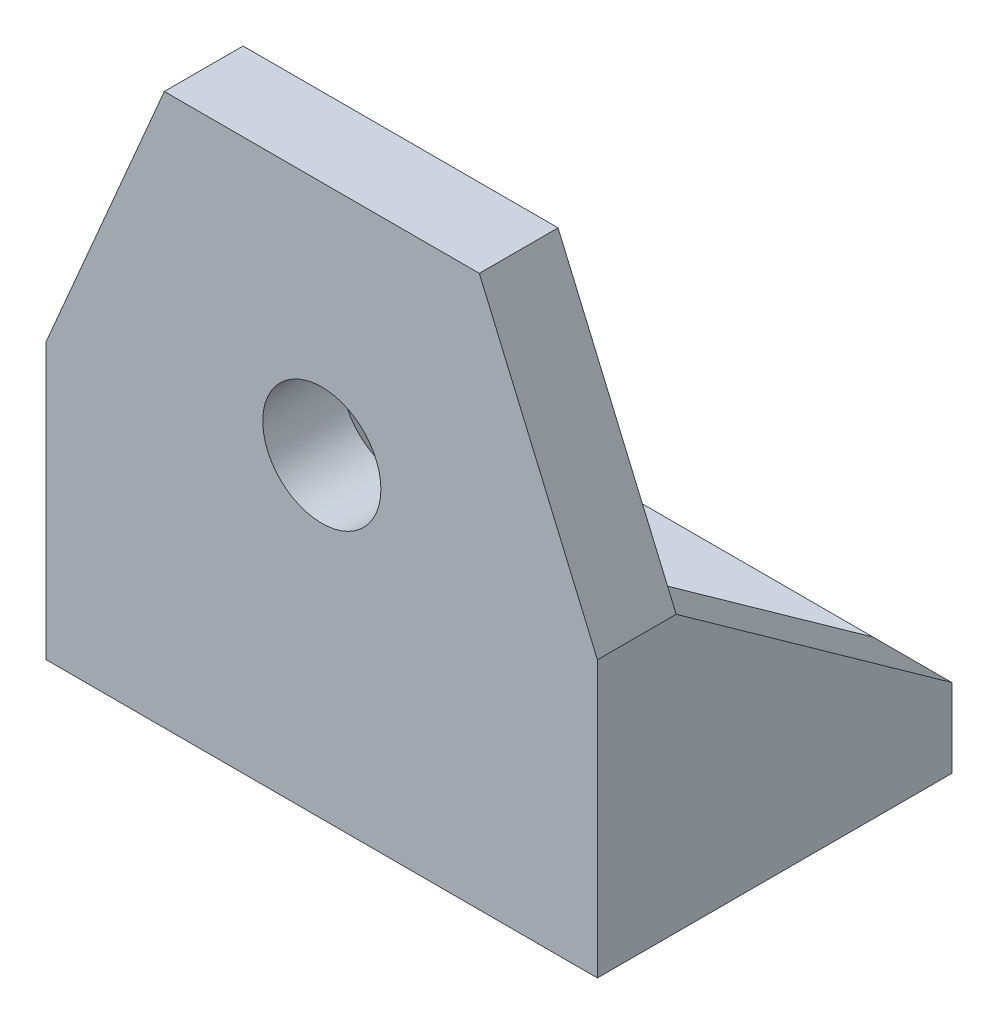
ISO-10303-21;
HEADER;
FILE_DESCRIPTION(('STEP AP214'),'2;1');
FILE_NAME('part.step','',(''),(''),'','','');
FILE_SCHEMA(('AUTOMOTIVE_DESIGN { 1 0 10303 214 1 1 1 1 }'));
ENDSEC;
DATA;
#1=APPLICATION_CONTEXT('core data for automotive mechanical design processes');
#2=APPLICATION_PROTOCOL_DEFINITION('international standard','automotive_design',2000,#1);
#3=PRODUCT_CONTEXT('',#1,'mechanical');
#4=PRODUCT('Part','Part','',(#3));
#5=PRODUCT_RELATED_PRODUCT_CATEGORY('part','',(#4));
#6=PRODUCT_DEFINITION_FORMATION('','',#4);
#7=PRODUCT_DEFINITION_CONTEXT('part definition',#1,'design');
#8=PRODUCT_DEFINITION('design','',#6,#7);
#9=PRODUCT_DEFINITION_SHAPE('','',#8);
#10=(LENGTH_UNIT() NAMED_UNIT(*) SI_UNIT(.MILLI.,.METRE.));
#11=(NAMED_UNIT(*) PLANE_ANGLE_UNIT() SI_UNIT($,.RADIAN.));
#12=(NAMED_UNIT(*) SI_UNIT($,.STERADIAN.) SOLID_ANGLE_UNIT());
#13=UNCERTAINTY_MEASURE_WITH_UNIT(LENGTH_MEASURE(1.E-05),#10,'distance_accuracy_value','');
#14=(GEOMETRIC_REPRESENTATION_CONTEXT(3) GLOBAL_UNCERTAINTY_ASSIGNED_CONTEXT((#13)) GLOBAL_UNIT_ASSIGNED_CONTEXT((#10,
#11,#12)) REPRESENTATION_CONTEXT('',''));
#15=CARTESIAN_POINT('',(0.,0.,0.));
#16=DIRECTION('',(0.,0.,1.));
#17=DIRECTION('',(1.,0.,0.));
#18=AXIS2_PLACEMENT_3D('',#15,#16,#17);
#19=CARTESIAN_POINT('',(0.,2.,0.));
#20=DIRECTION('',(0.,1.,0.));
#21=DIRECTION('',(0.,0.,1.));
#22=AXIS2_PLACEMENT_3D('',#19,#20,#21);
#23=PLANE('',#22);
#24=CARTESIAN_POINT('',(-3.,2.,-0.999999999999999));
#25=DIRECTION('',(0.,1.,0.));
#26=DIRECTION('',(0.,0.,1.));
#27=AXIS2_PLACEMENT_3D('',#24,#25,#26);
#28=CIRCLE('',#27,1.25);
#29=CARTESIAN_POINT('',(-3.,2.,0.250000000000002));
#30=VERTEX_POINT('',#29);
#31=EDGE_CURVE('E180',#30,#30,#28,.T.);
#32=ORIENTED_EDGE('',*,*,#31,.F.);
#33=EDGE_LOOP('',(#32));
#34=FACE_BOUND('',#33,.T.);
#35=CARTESIAN_POINT('',(3.,2.,-1.));
#36=DIRECTION('',(0.,1.,0.));
#37=DIRECTION('',(0.,0.,1.));
#38=AXIS2_PLACEMENT_3D('',#35,#36,#37);
#39=CIRCLE('',#38,1.25);
#40=CARTESIAN_POINT('',(3.,2.,0.249999999999998));
#41=VERTEX_POINT('',#40);
#42=EDGE_CURVE('E172',#41,#41,#39,.T.);
#43=ORIENTED_EDGE('',*,*,#42,.F.);
#44=EDGE_LOOP('',(#43));
#45=FACE_BOUND('',#44,.T.);
#46=DIRECTION('',(-1.,0.,0.));
#47=VECTOR('',#46,1.);
#48=CARTESIAN_POINT('',(-7.,2.,-4.5));
#49=LINE('',#48,#47);
#50=CARTESIAN_POINT('',(5.,2.,-4.5));
#51=VERTEX_POINT('',#50);
#52=CARTESIAN_POINT('',(-5.,2.,-4.5));
#53=VERTEX_POINT('',#52);
#54=EDGE_CURVE('E191',#51,#53,#49,.T.);
#55=ORIENTED_EDGE('',*,*,#54,.T.);
#56=DIRECTION('',(0.,0.,1.));
#57=VECTOR('',#56,1.);
#58=CARTESIAN_POINT('',(-5.,2.,-9.8851648071345));
#59=LINE('',#58,#57);
#60=CARTESIAN_POINT('',(-5.,2.,2.5));
#61=VERTEX_POINT('',#60);
#62=EDGE_CURVE('E55',#53,#61,#59,.T.);
#63=ORIENTED_EDGE('',*,*,#62,.T.);
#64=DIRECTION('',(-1.,0.,0.));
#65=VECTOR('',#64,1.);
#66=CARTESIAN_POINT('',(-7.,2.,2.5));
#67=LINE('',#66,#65);
#68=CARTESIAN_POINT('',(4.99999999999999,2.,2.5));
#69=VERTEX_POINT('',#68);
#70=EDGE_CURVE('E161',#69,#61,#67,.T.);
#71=ORIENTED_EDGE('',*,*,#70,.F.);
#72=DIRECTION('',(0.,0.,1.));
#73=VECTOR('',#72,1.);
#74=CARTESIAN_POINT('',(5.,2.,-9.8851648071345));
#75=LINE('',#74,#73);
#76=EDGE_CURVE('E126',#51,#69,#75,.T.);
#77=ORIENTED_EDGE('',*,*,#76,.F.);
#78=EDGE_LOOP('',(#55,#63,#71,#77));
#79=FACE_BOUND('',#78,.T.);
#80=ADVANCED_FACE('F39',(#34,#45,#79),#23,.T.);
#81=CARTESIAN_POINT('',(-7.,14.,2.5));
#82=DIRECTION('',(0.,0.,1.));
#83=DIRECTION('',(1.,0.,0.));
#84=AXIS2_PLACEMENT_3D('',#81,#82,#83);
#85=PLANE('',#84);
#86=CARTESIAN_POINT('',(0.,8.,2.5));
#87=DIRECTION('',(0.,0.,1.));
#88=DIRECTION('',(1.,0.,0.));
#89=AXIS2_PLACEMENT_3D('',#86,#87,#88);
#90=CIRCLE('',#89,1.5);
#91=CARTESIAN_POINT('',(1.5,8.,2.5));
#92=VERTEX_POINT('',#91);
#93=EDGE_CURVE('E138',#92,#92,#90,.F.);
#94=ORIENTED_EDGE('',*,*,#93,.F.);
#95=EDGE_LOOP('',(#94));
#96=FACE_BOUND('',#95,.T.);
#97=DIRECTION('',(0.,-1.,0.));
#98=VECTOR('',#97,1.);
#99=CARTESIAN_POINT('',(-5.,7.,2.5));
#100=LINE('',#99,#98);
#101=CARTESIAN_POINT('',(-5.,7.,2.5));
#102=VERTEX_POINT('',#101);
#103=EDGE_CURVE('E236',#102,#61,#100,.T.);
#104=ORIENTED_EDGE('',*,*,#103,.F.);
#105=DIRECTION('',(1.,0.,0.));
#106=VECTOR('',#105,1.);
#107=CARTESIAN_POINT('',(-7.,7.,2.5));
#108=LINE('',#107,#106);
#109=CARTESIAN_POINT('',(-7.,7.,2.5));
#110=VERTEX_POINT('',#109);
#111=EDGE_CURVE('E240',#110,#102,#108,.T.);
#112=ORIENTED_EDGE('',*,*,#111,.F.);
#113=DIRECTION('',(0.393919298579168,0.919145030018058,0.));
#114=VECTOR('',#113,1.);
#115=CARTESIAN_POINT('',(-4.46551724137931,12.9137931034483,2.5));
#116=LINE('',#115,#114);
#117=CARTESIAN_POINT('',(-4.,14.,2.5));
#118=VERTEX_POINT('',#117);
#119=EDGE_CURVE('E156',#110,#118,#116,.T.);
#120=ORIENTED_EDGE('',*,*,#119,.T.);
#121=DIRECTION('',(-1.,0.,0.));
#122=VECTOR('',#121,1.);
#123=CARTESIAN_POINT('',(-7.,14.,2.5));
#124=LINE('',#123,#122);
#125=CARTESIAN_POINT('',(4.,14.,2.5));
#126=VERTEX_POINT('',#125);
#127=EDGE_CURVE('E154',#126,#118,#124,.T.);
#128=ORIENTED_EDGE('',*,*,#127,.F.);
#129=DIRECTION('',(0.393919298579167,-0.919145030018058,0.));
#130=VECTOR('',#129,1.);
#131=CARTESIAN_POINT('',(2.29310344827586,17.9827586206897,2.5));
#132=LINE('',#131,#130);
#133=CARTESIAN_POINT('',(7.,7.,2.5));
#134=VERTEX_POINT('',#133);
#135=EDGE_CURVE('E142',#126,#134,#132,.T.);
#136=ORIENTED_EDGE('',*,*,#135,.T.);
#137=DIRECTION('',(1.,0.,0.));
#138=VECTOR('',#137,1.);
#139=CARTESIAN_POINT('',(7.,7.,2.5));
#140=LINE('',#139,#138);
#141=CARTESIAN_POINT('',(5.,7.,2.5));
#142=VERTEX_POINT('',#141);
#143=EDGE_CURVE('E117',#142,#134,#140,.T.);
#144=ORIENTED_EDGE('',*,*,#143,.F.);
#145=DIRECTION('',(0.,1.,0.));
#146=VECTOR('',#145,1.);
#147=CARTESIAN_POINT('',(5.,7.,2.5));
#148=LINE('',#147,#146);
#149=EDGE_CURVE('E127',#69,#142,#148,.T.);
#150=ORIENTED_EDGE('',*,*,#149,.F.);
#151=ORIENTED_EDGE('',*,*,#70,.T.);
#152=EDGE_LOOP('',(#104,#112,#120,#128,#136,#144,#150,#151));
#153=FACE_BOUND('',#152,.T.);
#154=ADVANCED_FACE('F151',(#96,#153),#85,.F.);
#155=CARTESIAN_POINT('',(7.,2.,-4.5));
#156=DIRECTION('',(-1.,0.,0.));
#157=DIRECTION('',(0.,0.,1.));
#158=AXIS2_PLACEMENT_3D('',#155,#156,#157);
#159=PLANE('',#158);
#160=DIRECTION('',(0.,-1.,0.));
#161=VECTOR('',#160,1.);
#162=CARTESIAN_POINT('',(7.,2.,-4.5));
#163=LINE('',#162,#161);
#164=CARTESIAN_POINT('',(7.,2.,-4.5));
#165=VERTEX_POINT('',#164);
#166=CARTESIAN_POINT('',(7.,0.,-4.5));
#167=VERTEX_POINT('',#166);
#168=EDGE_CURVE('E136',#165,#167,#163,.T.);
#169=ORIENTED_EDGE('',*,*,#168,.F.);
#170=DIRECTION('',(0.,-0.581238193719096,-0.813733471206735));
#171=VECTOR('',#170,1.);
#172=CARTESIAN_POINT('',(7.,7.,2.5));
#173=LINE('',#172,#171);
#174=EDGE_CURVE('E120',#134,#165,#173,.T.);
#175=ORIENTED_EDGE('',*,*,#174,.F.);
#176=DIRECTION('',(0.,0.,1.));
#177=VECTOR('',#176,1.);
#178=CARTESIAN_POINT('',(7.,7.,-7.5));
#179=LINE('',#178,#177);
#180=CARTESIAN_POINT('',(7.,7.,4.5));
#181=VERTEX_POINT('',#180);
#182=EDGE_CURVE('E133',#134,#181,#179,.T.);
#183=ORIENTED_EDGE('',*,*,#182,.T.);
#184=DIRECTION('',(0.,-1.,0.));
#185=VECTOR('',#184,1.);
#186=CARTESIAN_POINT('',(7.,2.,4.5));
#187=LINE('',#186,#185);
#188=CARTESIAN_POINT('',(7.,0.,4.5));
#189=VERTEX_POINT('',#188);
#190=EDGE_CURVE('E194',#181,#189,#187,.T.);
#191=ORIENTED_EDGE('',*,*,#190,.T.);
#192=DIRECTION('',(0.,0.,-1.));
#193=VECTOR('',#192,1.);
#194=CARTESIAN_POINT('',(7.,0.,-4.5));
#195=LINE('',#194,#193);
#196=EDGE_CURVE('E179',#189,#167,#195,.T.);
#197=ORIENTED_EDGE('',*,*,#196,.T.);
#198=EDGE_LOOP('',(#169,#175,#183,#191,#197));
#199=FACE_BOUND('',#198,.T.);
#200=ADVANCED_FACE('F41',(#199),#159,.F.);
#201=CARTESIAN_POINT('',(-7.,2.,-4.5));
#202=DIRECTION('',(0.,0.,1.));
#203=DIRECTION('',(1.,0.,0.));
#204=AXIS2_PLACEMENT_3D('',#201,#202,#203);
#205=PLANE('',#204);
#206=DIRECTION('',(0.,-1.,0.));
#207=VECTOR('',#206,1.);
#208=CARTESIAN_POINT('',(-7.,2.,-4.5));
#209=LINE('',#208,#207);
#210=CARTESIAN_POINT('',(-7.,2.,-4.5));
#211=VERTEX_POINT('',#210);
#212=CARTESIAN_POINT('',(-7.,0.,-4.5));
#213=VERTEX_POINT('',#212);
#214=EDGE_CURVE('E214',#211,#213,#209,.T.);
#215=ORIENTED_EDGE('',*,*,#214,.F.);
#216=DIRECTION('',(1.,0.,0.));
#217=VECTOR('',#216,1.);
#218=CARTESIAN_POINT('',(-15.6023252670426,2.,-4.5));
#219=LINE('',#218,#217);
#220=EDGE_CURVE('E252',#211,#53,#219,.T.);
#221=ORIENTED_EDGE('',*,*,#220,.T.);
#222=ORIENTED_EDGE('',*,*,#54,.F.);
#223=EDGE_CURVE('E63',#51,#165,#219,.T.);
#224=ORIENTED_EDGE('',*,*,#223,.T.);
#225=ORIENTED_EDGE('',*,*,#168,.T.);
#226=DIRECTION('',(-1.,0.,0.));
#227=VECTOR('',#226,1.);
#228=CARTESIAN_POINT('',(-7.,0.,-4.5));
#229=LINE('',#228,#227);
#230=EDGE_CURVE('E198',#167,#213,#229,.T.);
#231=ORIENTED_EDGE('',*,*,#230,.T.);
#232=EDGE_LOOP('',(#215,#221,#222,#224,#225,#231));
#233=FACE_BOUND('',#232,.T.);
#234=ADVANCED_FACE('F277',(#233),#205,.F.);
#235=CARTESIAN_POINT('',(-7.,2.,-4.5));
#236=DIRECTION('',(1.,0.,0.));
#237=DIRECTION('',(0.,0.,-1.));
#238=AXIS2_PLACEMENT_3D('',#235,#236,#237);
#239=PLANE('',#238);
#240=DIRECTION('',(0.,0.,1.));
#241=VECTOR('',#240,1.);
#242=CARTESIAN_POINT('',(-7.,7.,-7.5));
#243=LINE('',#242,#241);
#244=CARTESIAN_POINT('',(-7.,7.,4.5));
#245=VERTEX_POINT('',#244);
#246=EDGE_CURVE('E157',#110,#245,#243,.T.);
#247=ORIENTED_EDGE('',*,*,#246,.F.);
#248=DIRECTION('',(0.,0.581238193719097,0.813733471206735));
#249=VECTOR('',#248,1.);
#250=CARTESIAN_POINT('',(-7.,7.,2.5));
#251=LINE('',#250,#249);
#252=EDGE_CURVE('E249',#211,#110,#251,.T.);
#253=ORIENTED_EDGE('',*,*,#252,.F.);
#254=ORIENTED_EDGE('',*,*,#214,.T.);
#255=DIRECTION('',(0.,0.,1.));
#256=VECTOR('',#255,1.);
#257=CARTESIAN_POINT('',(-7.,0.,-4.5));
#258=LINE('',#257,#256);
#259=CARTESIAN_POINT('',(-7.,0.,4.5));
#260=VERTEX_POINT('',#259);
#261=EDGE_CURVE('E202',#213,#260,#258,.T.);
#262=ORIENTED_EDGE('',*,*,#261,.T.);
#263=DIRECTION('',(0.,-1.,0.));
#264=VECTOR('',#263,1.);
#265=CARTESIAN_POINT('',(-7.,2.,4.5));
#266=LINE('',#265,#264);
#267=EDGE_CURVE('E211',#245,#260,#266,.T.);
#268=ORIENTED_EDGE('',*,*,#267,.F.);
#269=EDGE_LOOP('',(#247,#253,#254,#262,#268));
#270=FACE_BOUND('',#269,.T.);
#271=ADVANCED_FACE('F268',(#270),#239,.F.);
#272=CARTESIAN_POINT('',(-7.,2.,4.5));
#273=DIRECTION('',(0.,0.,-1.));
#274=DIRECTION('',(-1.,0.,0.));
#275=AXIS2_PLACEMENT_3D('',#272,#273,#274);
#276=PLANE('',#275);
#277=CARTESIAN_POINT('',(0.,8.,4.5));
#278=DIRECTION('',(0.,0.,1.));
#279=DIRECTION('',(1.,0.,0.));
#280=AXIS2_PLACEMENT_3D('',#277,#278,#279);
#281=CIRCLE('',#280,1.5);
#282=CARTESIAN_POINT('',(1.5,8.,4.5));
#283=VERTEX_POINT('',#282);
#284=EDGE_CURVE('E259',#283,#283,#281,.T.);
#285=ORIENTED_EDGE('',*,*,#284,.F.);
#286=EDGE_LOOP('',(#285));
#287=FACE_BOUND('',#286,.T.);
#288=DIRECTION('',(1.,0.,0.));
#289=VECTOR('',#288,1.);
#290=CARTESIAN_POINT('',(-7.,14.,4.5));
#291=LINE('',#290,#289);
#292=CARTESIAN_POINT('',(-4.,14.,4.5));
#293=VERTEX_POINT('',#292);
#294=CARTESIAN_POINT('',(4.,14.,4.5));
#295=VERTEX_POINT('',#294);
#296=EDGE_CURVE('E166',#293,#295,#291,.T.);
#297=ORIENTED_EDGE('',*,*,#296,.F.);
#298=DIRECTION('',(0.393919298579168,0.919145030018058,0.));
#299=VECTOR('',#298,1.);
#300=CARTESIAN_POINT('',(-7.,7.,4.5));
#301=LINE('',#300,#299);
#302=EDGE_CURVE('E147',#245,#293,#301,.T.);
#303=ORIENTED_EDGE('',*,*,#302,.F.);
#304=ORIENTED_EDGE('',*,*,#267,.T.);
#305=DIRECTION('',(1.,0.,0.));
#306=VECTOR('',#305,1.);
#307=CARTESIAN_POINT('',(-7.,0.,4.5));
#308=LINE('',#307,#306);
#309=EDGE_CURVE('E195',#260,#189,#308,.T.);
#310=ORIENTED_EDGE('',*,*,#309,.T.);
#311=ORIENTED_EDGE('',*,*,#190,.F.);
#312=DIRECTION('',(0.393919298579167,-0.919145030018058,0.));
#313=VECTOR('',#312,1.);
#314=CARTESIAN_POINT('',(4.,14.,4.5));
#315=LINE('',#314,#313);
#316=EDGE_CURVE('E145',#295,#181,#315,.T.);
#317=ORIENTED_EDGE('',*,*,#316,.F.);
#318=EDGE_LOOP('',(#297,#303,#304,#310,#311,#317));
#319=FACE_BOUND('',#318,.T.);
#320=ADVANCED_FACE('F223',(#287,#319),#276,.F.);
#321=CARTESIAN_POINT('',(0.,0.,0.));
#322=DIRECTION('',(0.,1.,0.));
#323=DIRECTION('',(0.,0.,1.));
#324=AXIS2_PLACEMENT_3D('',#321,#322,#323);
#325=PLANE('',#324);
#326=CARTESIAN_POINT('',(-3.,0.,-0.999999999999999));
#327=DIRECTION('',(0.,1.,0.));
#328=DIRECTION('',(0.,0.,1.));
#329=AXIS2_PLACEMENT_3D('',#326,#327,#328);
#330=CIRCLE('',#329,1.25);
#331=CARTESIAN_POINT('',(-3.,0.,0.250000000000002));
#332=VERTEX_POINT('',#331);
#333=EDGE_CURVE('E175',#332,#332,#330,.T.);
#334=ORIENTED_EDGE('',*,*,#333,.T.);
#335=EDGE_LOOP('',(#334));
#336=FACE_BOUND('',#335,.T.);
#337=CARTESIAN_POINT('',(3.,0.,-1.));
#338=DIRECTION('',(0.,1.,0.));
#339=DIRECTION('',(0.,0.,1.));
#340=AXIS2_PLACEMENT_3D('',#337,#338,#339);
#341=CIRCLE('',#340,1.25);
#342=CARTESIAN_POINT('',(3.,0.,0.249999999999998));
#343=VERTEX_POINT('',#342);
#344=EDGE_CURVE('E184',#343,#343,#341,.T.);
#345=ORIENTED_EDGE('',*,*,#344,.T.);
#346=EDGE_LOOP('',(#345));
#347=FACE_BOUND('',#346,.T.);
#348=ORIENTED_EDGE('',*,*,#196,.F.);
#349=ORIENTED_EDGE('',*,*,#309,.F.);
#350=ORIENTED_EDGE('',*,*,#261,.F.);
#351=ORIENTED_EDGE('',*,*,#230,.F.);
#352=EDGE_LOOP('',(#348,#349,#350,#351));
#353=FACE_BOUND('',#352,.T.);
#354=ADVANCED_FACE('F267',(#336,#347,#353),#325,.F.);
#355=CARTESIAN_POINT('',(3.,0.,-1.));
#356=DIRECTION('',(0.,1.,0.));
#357=DIRECTION('',(0.,0.,1.));
#358=AXIS2_PLACEMENT_3D('',#355,#356,#357);
#359=CYLINDRICAL_SURFACE('',#358,1.25);
#360=ORIENTED_EDGE('',*,*,#344,.F.);
#361=EDGE_LOOP('',(#360));
#362=FACE_BOUND('',#361,.T.);
#363=ORIENTED_EDGE('',*,*,#42,.T.);
#364=EDGE_LOOP('',(#363));
#365=FACE_BOUND('',#364,.T.);
#366=ADVANCED_FACE('F274',(#362,#365),#359,.F.);
#367=CARTESIAN_POINT('',(-3.,0.,-0.999999999999999));
#368=DIRECTION('',(0.,1.,0.));
#369=DIRECTION('',(0.,0.,1.));
#370=AXIS2_PLACEMENT_3D('',#367,#368,#369);
#371=CYLINDRICAL_SURFACE('',#370,1.25);
#372=ORIENTED_EDGE('',*,*,#333,.F.);
#373=EDGE_LOOP('',(#372));
#374=FACE_BOUND('',#373,.T.);
#375=ORIENTED_EDGE('',*,*,#31,.T.);
#376=EDGE_LOOP('',(#375));
#377=FACE_BOUND('',#376,.T.);
#378=ADVANCED_FACE('F293',(#374,#377),#371,.F.);
#379=CARTESIAN_POINT('',(0.,14.,0.));
#380=DIRECTION('',(0.,-1.,0.));
#381=DIRECTION('',(0.,0.,-1.));
#382=AXIS2_PLACEMENT_3D('',#379,#380,#381);
#383=PLANE('',#382);
#384=ORIENTED_EDGE('',*,*,#127,.T.);
#385=DIRECTION('',(0.,0.,1.));
#386=VECTOR('',#385,1.);
#387=CARTESIAN_POINT('',(-4.,14.,0.));
#388=LINE('',#387,#386);
#389=EDGE_CURVE('E11',#118,#293,#388,.T.);
#390=ORIENTED_EDGE('',*,*,#389,.T.);
#391=ORIENTED_EDGE('',*,*,#296,.T.);
#392=DIRECTION('',(0.,0.,-1.));
#393=VECTOR('',#392,1.);
#394=CARTESIAN_POINT('',(4.,14.,0.));
#395=LINE('',#394,#393);
#396=EDGE_CURVE('E48',#295,#126,#395,.T.);
#397=ORIENTED_EDGE('',*,*,#396,.T.);
#398=EDGE_LOOP('',(#384,#390,#391,#397));
#399=FACE_BOUND('',#398,.T.);
#400=ADVANCED_FACE('F220',(#399),#383,.F.);
#401=CARTESIAN_POINT('',(4.,14.,-7.5));
#402=DIRECTION('',(-0.919145030018058,-0.393919298579167,0.));
#403=DIRECTION('',(0.393919298579167,-0.919145030018058,0.));
#404=AXIS2_PLACEMENT_3D('',#401,#402,#403);
#405=PLANE('',#404);
#406=ORIENTED_EDGE('',*,*,#396,.F.);
#407=ORIENTED_EDGE('',*,*,#316,.T.);
#408=ORIENTED_EDGE('',*,*,#182,.F.);
#409=ORIENTED_EDGE('',*,*,#135,.F.);
#410=EDGE_LOOP('',(#406,#407,#408,#409));
#411=FACE_BOUND('',#410,.T.);
#412=ADVANCED_FACE('F141',(#411),#405,.F.);
#413=CARTESIAN_POINT('',(-7.,7.,-7.5));
#414=DIRECTION('',(0.919145030018058,-0.393919298579168,0.));
#415=DIRECTION('',(0.393919298579168,0.919145030018058,0.));
#416=AXIS2_PLACEMENT_3D('',#413,#414,#415);
#417=PLANE('',#416);
#418=ORIENTED_EDGE('',*,*,#246,.T.);
#419=ORIENTED_EDGE('',*,*,#302,.T.);
#420=ORIENTED_EDGE('',*,*,#389,.F.);
#421=ORIENTED_EDGE('',*,*,#119,.F.);
#422=EDGE_LOOP('',(#418,#419,#420,#421));
#423=FACE_BOUND('',#422,.T.);
#424=ADVANCED_FACE('F302',(#423),#417,.F.);
#425=CARTESIAN_POINT('',(5.,7.,-9.8851648071345));
#426=DIRECTION('',(1.,0.,0.));
#427=DIRECTION('',(0.,0.,-1.));
#428=AXIS2_PLACEMENT_3D('',#425,#426,#427);
#429=PLANE('',#428);
#430=ORIENTED_EDGE('',*,*,#149,.T.);
#431=DIRECTION('',(0.,-0.581238193719096,-0.813733471206735));
#432=VECTOR('',#431,1.);
#433=CARTESIAN_POINT('',(5.,1.14215178040936,-5.7009875074269));
#434=LINE('',#433,#432);
#435=EDGE_CURVE('E121',#142,#51,#434,.T.);
#436=ORIENTED_EDGE('',*,*,#435,.T.);
#437=ORIENTED_EDGE('',*,*,#76,.T.);
#438=EDGE_LOOP('',(#430,#436,#437));
#439=FACE_BOUND('',#438,.T.);
#440=ADVANCED_FACE('F305',(#439),#429,.F.);
#441=CARTESIAN_POINT('',(-5.,7.,-9.8851648071345));
#442=DIRECTION('',(-1.,0.,0.));
#443=DIRECTION('',(0.,-1.,0.));
#444=AXIS2_PLACEMENT_3D('',#441,#442,#443);
#445=PLANE('',#444);
#446=ORIENTED_EDGE('',*,*,#62,.F.);
#447=DIRECTION('',(0.,0.581238193719096,0.813733471206735));
#448=VECTOR('',#447,1.);
#449=CARTESIAN_POINT('',(-5.,1.14215178040936,-5.7009875074269));
#450=LINE('',#449,#448);
#451=EDGE_CURVE('E245',#53,#102,#450,.T.);
#452=ORIENTED_EDGE('',*,*,#451,.T.);
#453=ORIENTED_EDGE('',*,*,#103,.T.);
#454=EDGE_LOOP('',(#446,#452,#453));
#455=FACE_BOUND('',#454,.T.);
#456=ADVANCED_FACE('F309',(#455),#445,.F.);
#457=CARTESIAN_POINT('',(-15.6023252670426,7.,2.5));
#458=DIRECTION('',(0.,-0.813733471206735,0.581238193719097));
#459=DIRECTION('',(0.,-0.581238193719097,-0.813733471206735));
#460=AXIS2_PLACEMENT_3D('',#457,#458,#459);
#461=PLANE('',#460);
#462=ORIENTED_EDGE('',*,*,#220,.F.);
#463=ORIENTED_EDGE('',*,*,#252,.T.);
#464=ORIENTED_EDGE('',*,*,#111,.T.);
#465=ORIENTED_EDGE('',*,*,#451,.F.);
#466=EDGE_LOOP('',(#462,#463,#464,#465));
#467=FACE_BOUND('',#466,.T.);
#468=ADVANCED_FACE('F313',(#467),#461,.F.);
#469=ORIENTED_EDGE('',*,*,#143,.T.);
#470=ORIENTED_EDGE('',*,*,#174,.T.);
#471=ORIENTED_EDGE('',*,*,#223,.F.);
#472=ORIENTED_EDGE('',*,*,#435,.F.);
#473=EDGE_LOOP('',(#469,#470,#471,#472));
#474=FACE_BOUND('',#473,.T.);
#475=ADVANCED_FACE('F119',(#474),#461,.F.);
#476=CARTESIAN_POINT('',(0.,8.,-1.74264068711929));
#477=DIRECTION('',(0.,0.,1.));
#478=DIRECTION('',(1.,0.,0.));
#479=AXIS2_PLACEMENT_3D('',#476,#477,#478);
#480=CYLINDRICAL_SURFACE('',#479,1.5);
#481=ORIENTED_EDGE('',*,*,#93,.T.);
#482=EDGE_LOOP('',(#481));
#483=FACE_BOUND('',#482,.T.);
#484=ORIENTED_EDGE('',*,*,#284,.T.);
#485=EDGE_LOOP('',(#484));
#486=FACE_BOUND('',#485,.T.);
#487=ADVANCED_FACE('F264',(#483,#486),#480,.F.);
#488=CLOSED_SHELL('',(#80,#154,#200,#234,#271,#320,#354,#366,#378,#400,#412,#424,#440,#456,#468,
#475,#487));
#489=MANIFOLD_SOLID_BREP('B2',#488);
#490=ADVANCED_BREP_SHAPE_REPRESENTATION('',(#18,#489),#14);
#491=SHAPE_DEFINITION_REPRESENTATION(#9,#490);
ENDSEC;
END-ISO-10303-21;
